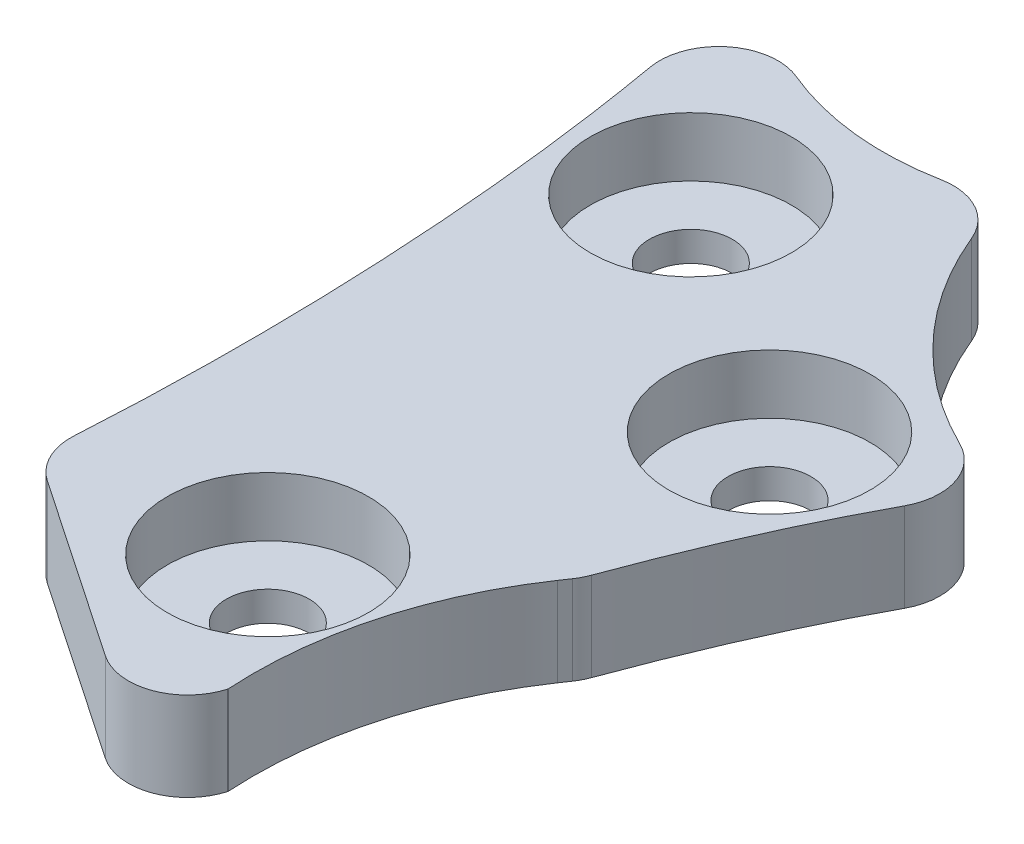
ISO-10303-21;
HEADER;
FILE_DESCRIPTION(('STEP AP214'),'2;1');
FILE_NAME('part.step','',(''),(''),'','','');
FILE_SCHEMA(('AUTOMOTIVE_DESIGN { 1 0 10303 214 1 1 1 1 }'));
ENDSEC;
DATA;
#1=APPLICATION_CONTEXT('core data for automotive mechanical design processes');
#2=APPLICATION_PROTOCOL_DEFINITION('international standard','automotive_design',2000,#1);
#3=PRODUCT_CONTEXT('',#1,'mechanical');
#4=PRODUCT('Part','Part','',(#3));
#5=PRODUCT_RELATED_PRODUCT_CATEGORY('part','',(#4));
#6=PRODUCT_DEFINITION_FORMATION('','',#4);
#7=PRODUCT_DEFINITION_CONTEXT('part definition',#1,'design');
#8=PRODUCT_DEFINITION('design','',#6,#7);
#9=PRODUCT_DEFINITION_SHAPE('','',#8);
#10=(LENGTH_UNIT() NAMED_UNIT(*) SI_UNIT(.MILLI.,.METRE.));
#11=(NAMED_UNIT(*) PLANE_ANGLE_UNIT() SI_UNIT($,.RADIAN.));
#12=(NAMED_UNIT(*) SI_UNIT($,.STERADIAN.) SOLID_ANGLE_UNIT());
#13=UNCERTAINTY_MEASURE_WITH_UNIT(LENGTH_MEASURE(1.E-05),#10,'distance_accuracy_value','');
#14=(GEOMETRIC_REPRESENTATION_CONTEXT(3) GLOBAL_UNCERTAINTY_ASSIGNED_CONTEXT((#13)) GLOBAL_UNIT_ASSIGNED_CONTEXT((#10,
#11,#12)) REPRESENTATION_CONTEXT('',''));
#15=CARTESIAN_POINT('',(0.,0.,0.));
#16=DIRECTION('',(0.,0.,1.));
#17=DIRECTION('',(1.,0.,0.));
#18=AXIS2_PLACEMENT_3D('',#15,#16,#17);
#19=CARTESIAN_POINT('',(72.2638227481414,13.5,-58.9739479500879));
#20=DIRECTION('',(0.,-1.,0.));
#21=DIRECTION('',(0.,0.,-1.));
#22=AXIS2_PLACEMENT_3D('',#19,#20,#21);
#23=CYLINDRICAL_SURFACE('',#22,0.700000000000001);
#24=CARTESIAN_POINT('',(72.2638227481414,12.,-58.9739479500879));
#25=DIRECTION('',(0.,1.,0.));
#26=DIRECTION('',(0.,0.,1.));
#27=AXIS2_PLACEMENT_3D('',#24,#25,#26);
#28=CIRCLE('',#27,0.700000000000001);
#29=CARTESIAN_POINT('',(72.2638227481414,12.,-58.2739479500879));
#30=VERTEX_POINT('',#29);
#31=EDGE_CURVE('E625',#30,#30,#28,.T.);
#32=ORIENTED_EDGE('',*,*,#31,.F.);
#33=EDGE_LOOP('',(#32));
#34=FACE_BOUND('',#33,.T.);
#35=CARTESIAN_POINT('',(72.2638227481414,12.5,-58.9739479500879));
#36=DIRECTION('',(0.,1.,0.));
#37=DIRECTION('',(0.,0.,1.));
#38=AXIS2_PLACEMENT_3D('',#35,#36,#37);
#39=CIRCLE('',#38,0.700000000000001);
#40=CARTESIAN_POINT('',(72.2638227481414,12.5,-58.2739479500879));
#41=VERTEX_POINT('',#40);
#42=EDGE_CURVE('E637',#41,#41,#39,.T.);
#43=ORIENTED_EDGE('',*,*,#42,.T.);
#44=EDGE_LOOP('',(#43));
#45=FACE_BOUND('',#44,.T.);
#46=ADVANCED_FACE('F374',(#34,#45),#23,.F.);
#47=CARTESIAN_POINT('',(74.7091319706028,13.5,-65.0056021593207));
#48=DIRECTION('',(0.,-1.,0.));
#49=DIRECTION('',(0.,0.,-1.));
#50=AXIS2_PLACEMENT_3D('',#47,#48,#49);
#51=CYLINDRICAL_SURFACE('',#50,0.700000000000003);
#52=CARTESIAN_POINT('',(74.7091319706028,12.,-65.0056021593207));
#53=DIRECTION('',(0.,1.,0.));
#54=DIRECTION('',(0.,0.,1.));
#55=AXIS2_PLACEMENT_3D('',#52,#53,#54);
#56=CIRCLE('',#55,0.700000000000003);
#57=CARTESIAN_POINT('',(74.7091319706028,12.,-64.3056021593207));
#58=VERTEX_POINT('',#57);
#59=EDGE_CURVE('E628',#58,#58,#56,.T.);
#60=ORIENTED_EDGE('',*,*,#59,.F.);
#61=EDGE_LOOP('',(#60));
#62=FACE_BOUND('',#61,.T.);
#63=CARTESIAN_POINT('',(74.7091319706028,12.5,-65.0056021593207));
#64=DIRECTION('',(0.,1.,0.));
#65=DIRECTION('',(0.,0.,1.));
#66=AXIS2_PLACEMENT_3D('',#63,#64,#65);
#67=CIRCLE('',#66,0.700000000000003);
#68=CARTESIAN_POINT('',(74.7091319706028,12.5,-64.3056021593207));
#69=VERTEX_POINT('',#68);
#70=EDGE_CURVE('E697',#69,#69,#67,.T.);
#71=ORIENTED_EDGE('',*,*,#70,.T.);
#72=EDGE_LOOP('',(#71));
#73=FACE_BOUND('',#72,.T.);
#74=ADVANCED_FACE('F687',(#62,#73),#51,.F.);
#75=CARTESIAN_POINT('',(70.5720234472234,13.5,-67.8135076181604));
#76=DIRECTION('',(0.,-1.,0.));
#77=DIRECTION('',(0.,0.,-1.));
#78=AXIS2_PLACEMENT_3D('',#75,#76,#77);
#79=CYLINDRICAL_SURFACE('',#78,0.700000000000003);
#80=CARTESIAN_POINT('',(70.5720234472234,12.,-67.8135076181604));
#81=DIRECTION('',(0.,1.,0.));
#82=DIRECTION('',(0.,0.,1.));
#83=AXIS2_PLACEMENT_3D('',#80,#81,#82);
#84=CIRCLE('',#83,0.700000000000003);
#85=CARTESIAN_POINT('',(70.5720234472234,12.,-67.1135076181604));
#86=VERTEX_POINT('',#85);
#87=EDGE_CURVE('E632',#86,#86,#84,.T.);
#88=ORIENTED_EDGE('',*,*,#87,.F.);
#89=EDGE_LOOP('',(#88));
#90=FACE_BOUND('',#89,.T.);
#91=CARTESIAN_POINT('',(70.5720234472234,12.5,-67.8135076181604));
#92=DIRECTION('',(0.,1.,0.));
#93=DIRECTION('',(0.,0.,1.));
#94=AXIS2_PLACEMENT_3D('',#91,#92,#93);
#95=CIRCLE('',#94,0.700000000000003);
#96=CARTESIAN_POINT('',(70.5720234472234,12.5,-67.1135076181604));
#97=VERTEX_POINT('',#96);
#98=EDGE_CURVE('E645',#97,#97,#95,.T.);
#99=ORIENTED_EDGE('',*,*,#98,.T.);
#100=EDGE_LOOP('',(#99));
#101=FACE_BOUND('',#100,.T.);
#102=ADVANCED_FACE('F526',(#90,#101),#79,.F.);
#103=CARTESIAN_POINT('',(80.8799392134065,13.5,-57.1137887375775));
#104=DIRECTION('',(0.,1.,0.));
#105=DIRECTION('',(0.,0.,1.));
#106=AXIS2_PLACEMENT_3D('',#103,#104,#105);
#107=PLANE('',#106);
#108=CARTESIAN_POINT('',(72.2638227481414,13.5,-58.9739479500879));
#109=DIRECTION('',(0.,1.,0.));
#110=DIRECTION('',(0.,0.,1.));
#111=AXIS2_PLACEMENT_3D('',#108,#109,#110);
#112=CIRCLE('',#111,1.70000000000001);
#113=CARTESIAN_POINT('',(72.2638227481414,13.5,-57.2739479500879));
#114=VERTEX_POINT('',#113);
#115=EDGE_CURVE('E646',#114,#114,#112,.T.);
#116=ORIENTED_EDGE('',*,*,#115,.F.);
#117=EDGE_LOOP('',(#116));
#118=FACE_BOUND('',#117,.T.);
#119=CARTESIAN_POINT('',(74.7091319706028,13.5,-65.0056021593207));
#120=DIRECTION('',(0.,1.,0.));
#121=DIRECTION('',(0.,0.,1.));
#122=AXIS2_PLACEMENT_3D('',#119,#120,#121);
#123=CIRCLE('',#122,1.70000000000001);
#124=CARTESIAN_POINT('',(74.7091319706028,13.5,-63.3056021593207));
#125=VERTEX_POINT('',#124);
#126=EDGE_CURVE('E652',#125,#125,#123,.T.);
#127=ORIENTED_EDGE('',*,*,#126,.F.);
#128=EDGE_LOOP('',(#127));
#129=FACE_BOUND('',#128,.T.);
#130=CARTESIAN_POINT('',(70.5720234472234,13.5,-67.8135076181604));
#131=DIRECTION('',(0.,1.,0.));
#132=DIRECTION('',(0.,0.,1.));
#133=AXIS2_PLACEMENT_3D('',#130,#131,#132);
#134=CIRCLE('',#133,1.70000000000001);
#135=CARTESIAN_POINT('',(70.5720234472234,13.5,-66.1135076181603));
#136=VERTEX_POINT('',#135);
#137=EDGE_CURVE('E638',#136,#136,#134,.T.);
#138=ORIENTED_EDGE('',*,*,#137,.F.);
#139=EDGE_LOOP('',(#138));
#140=FACE_BOUND('',#139,.T.);
#141=CARTESIAN_POINT('',(71.5720234472234,13.5,-74.8135076181604));
#142=DIRECTION('',(0.,-1.,0.));
#143=DIRECTION('',(0.,0.,1.));
#144=AXIS2_PLACEMENT_3D('',#141,#142,#143);
#145=CIRCLE('',#144,4.75);
#146=CARTESIAN_POINT('',(72.4683395299941,13.5,-70.1488406976004));
#147=VERTEX_POINT('',#146);
#148=CARTESIAN_POINT('',(69.7321408874091,13.5,-70.4343145228412));
#149=VERTEX_POINT('',#148);
#150=EDGE_CURVE('E563',#147,#149,#145,.T.);
#151=ORIENTED_EDGE('',*,*,#150,.T.);
#152=CARTESIAN_POINT('',(69.3447971906061,13.5,-69.5123791343529));
#153=DIRECTION('',(0.,1.,0.));
#154=DIRECTION('',(0.,0.,1.));
#155=AXIS2_PLACEMENT_3D('',#152,#153,#154);
#156=CIRCLE('',#155,1.);
#157=CARTESIAN_POINT('',(68.3597841618872,13.5,-69.3396722839055));
#158=VERTEX_POINT('',#157);
#159=EDGE_CURVE('E12',#149,#158,#156,.T.);
#160=ORIENTED_EDGE('',*,*,#159,.T.);
#161=CARTESIAN_POINT('',(68.8890316319641,13.5,-59.0760100308946));
#162=CARTESIAN_POINT('',(68.9430490469193,13.5,-59.9636197636759));
#163=CARTESIAN_POINT('',(68.9711298068894,13.5,-60.8525883147822));
#164=CARTESIAN_POINT('',(68.9776496461561,13.5,-62.8176238059093));
#165=CARTESIAN_POINT('',(68.9453470630465,13.5,-63.8940870276276));
#166=CARTESIAN_POINT('',(68.804800726142,13.5,-66.0459856312375));
#167=CARTESIAN_POINT('',(68.6957766560887,13.5,-67.1178787166003));
#168=CARTESIAN_POINT('',(68.488180782614,13.5,-68.5698284901652));
#169=CARTESIAN_POINT('',(68.4272267815894,13.5,-68.9552480453798));
#170=CARTESIAN_POINT('',(68.3598227341784,13.5,-69.3396790469619));
#171=B_SPLINE_CURVE_WITH_KNOTS('',3,(#161,#162,#163,#164,#165,#166,#167,#168,#169,#170),
.UNSPECIFIED.,.F.,.F.,(4,2,2,2,4),(0.159481537734136,0.36563959977013,0.61563959977013,
0.86563959977013,0.956158062035995),.UNSPECIFIED.);
#172=CARTESIAN_POINT('',(68.889034732794,13.5,-59.0760098421869));
#173=VERTEX_POINT('',#172);
#174=EDGE_CURVE('E608',#158,#173,#171,.F.);
#175=ORIENTED_EDGE('',*,*,#174,.T.);
#176=CARTESIAN_POINT('',(69.8871849624101,13.5,-59.0152652457716));
#177=DIRECTION('',(0.,1.,0.));
#178=DIRECTION('',(0.,0.,1.));
#179=AXIS2_PLACEMENT_3D('',#176,#177,#178);
#180=CIRCLE('',#179,1.);
#181=CARTESIAN_POINT('',(69.3256038706421,13.5,-58.1878435410957));
#182=VERTEX_POINT('',#181);
#183=EDGE_CURVE('E787',#173,#182,#180,.T.);
#184=ORIENTED_EDGE('',*,*,#183,.T.);
#185=DIRECTION('',(0.827421704675876,0.,0.561581091767937));
#186=VECTOR('',#185,1.);
#187=CARTESIAN_POINT('',(68.8510426391012,13.5,-58.5099339733547));
#188=LINE('',#187,#186);
#189=CARTESIAN_POINT('',(72.3716664457096,13.5,-56.1204441281568));
#190=VERTEX_POINT('',#189);
#191=EDGE_CURVE('E503',#182,#190,#188,.T.);
#192=ORIENTED_EDGE('',*,*,#191,.T.);
#193=CARTESIAN_POINT('',(72.9332475374775,13.5,-56.9478658328327));
#194=DIRECTION('',(0.,1.,0.));
#195=DIRECTION('',(0.,0.,1.));
#196=AXIS2_PLACEMENT_3D('',#193,#194,#195);
#197=CIRCLE('',#196,1.);
#198=CARTESIAN_POINT('',(73.8939934398076,13.5,-56.6704360017835));
#199=VERTEX_POINT('',#198);
#200=EDGE_CURVE('E488',#190,#199,#197,.T.);
#201=ORIENTED_EDGE('',*,*,#200,.T.);
#202=CARTESIAN_POINT('',(80.8799392134065,13.5,-57.1137887375775));
#203=DIRECTION('',(0.,-1.,0.));
#204=DIRECTION('',(0.,0.,1.));
#205=AXIS2_PLACEMENT_3D('',#202,#203,#204);
#206=CIRCLE('',#205,7.00000000000001);
#207=CARTESIAN_POINT('',(75.0879872806754,13.5,-61.0448563799531));
#208=VERTEX_POINT('',#207);
#209=EDGE_CURVE('E482',#199,#208,#206,.T.);
#210=ORIENTED_EDGE('',*,*,#209,.T.);
#211=DIRECTION('',(0.561581091768055,0.,-0.827421704675795));
#212=VECTOR('',#211,1.);
#213=CARTESIAN_POINT('',(75.0879872806754,13.5,-61.0448563799531));
#214=LINE('',#213,#212);
#215=CARTESIAN_POINT('',(75.1890511431007,13.5,-61.1937617376207));
#216=VERTEX_POINT('',#215);
#217=EDGE_CURVE('E470',#208,#216,#214,.T.);
#218=ORIENTED_EDGE('',*,*,#217,.T.);
#219=CARTESIAN_POINT('',(74.3616294384249,13.5,-61.7553428293887));
#220=DIRECTION('',(0.,1.,0.));
#221=DIRECTION('',(0.,0.,1.));
#222=AXIS2_PLACEMENT_3D('',#219,#220,#221);
#223=CIRCLE('',#222,1.);
#224=CARTESIAN_POINT('',(75.3003538092592,13.5,-61.4106706861503));
#225=VERTEX_POINT('',#224);
#226=EDGE_CURVE('E794',#216,#225,#223,.T.);
#227=ORIENTED_EDGE('',*,*,#226,.T.);
#228=CARTESIAN_POINT('',(76.9276341794383,13.5,-65.0651191019532));
#229=CARTESIAN_POINT('',(76.6902697689844,13.5,-64.6288377391433));
#230=CARTESIAN_POINT('',(76.4688595301773,13.5,-64.183942429396));
#231=CARTESIAN_POINT('',(75.9060309782182,13.5,-62.9735073442266));
#232=CARTESIAN_POINT('',(75.5891769925725,13.5,-62.1972922099058));
#233=CARTESIAN_POINT('',(75.300352715308,13.5,-61.4106710878172));
#234=B_SPLINE_CURVE_WITH_KNOTS('',3,(#228,#229,#230,#231,#232,#233),.UNSPECIFIED.,.F.,.F.,(4,2,
4),(0.0231369779908018,0.306065370487194,0.782928392496392),.UNSPECIFIED.);
#235=CARTESIAN_POINT('',(76.9277741043817,13.5,-65.0650429740126));
#236=VERTEX_POINT('',#235);
#237=EDGE_CURVE('E481',#225,#236,#234,.F.);
#238=ORIENTED_EDGE('',*,*,#237,.T.);
#239=CARTESIAN_POINT('',(76.0492251209714,13.5,-65.5430286394217));
#240=DIRECTION('',(0.,1.,0.));
#241=DIRECTION('',(0.,0.,1.));
#242=AXIS2_PLACEMENT_3D('',#239,#240,#241);
#243=CIRCLE('',#242,1.);
#244=CARTESIAN_POINT('',(76.489549065633,13.5,-66.4408676137138));
#245=VERTEX_POINT('',#244);
#246=EDGE_CURVE('E782',#236,#245,#243,.T.);
#247=ORIENTED_EDGE('',*,*,#246,.T.);
#248=CARTESIAN_POINT('',(79.1314927336023,13.5,-71.8279014594657));
#249=DIRECTION('',(0.,-1.,0.));
#250=DIRECTION('',(0.,0.,1.));
#251=AXIS2_PLACEMENT_3D('',#248,#249,#250);
#252=CIRCLE('',#251,5.99999999999999);
#253=CARTESIAN_POINT('',(73.5819598070998,13.5,-69.5469621140064));
#254=VERTEX_POINT('',#253);
#255=EDGE_CURVE('E559',#245,#254,#252,.T.);
#256=ORIENTED_EDGE('',*,*,#255,.T.);
#257=CARTESIAN_POINT('',(72.6570376526827,13.5,-69.1668055564299));
#258=DIRECTION('',(0.,1.,0.));
#259=DIRECTION('',(0.,0.,1.));
#260=AXIS2_PLACEMENT_3D('',#257,#258,#259);
#261=CIRCLE('',#260,1.);
#262=EDGE_CURVE('E798',#254,#147,#261,.T.);
#263=ORIENTED_EDGE('',*,*,#262,.T.);
#264=EDGE_LOOP('',(#151,#160,#175,#184,#192,#201,#210,#218,#227,#238,#247,#256,#263));
#265=FACE_BOUND('',#264,.T.);
#266=ADVANCED_FACE('F485',(#118,#129,#140,#265),#107,.T.);
#267=CARTESIAN_POINT('',(80.8799392134065,12.,-57.1137887375775));
#268=DIRECTION('',(0.,1.,0.));
#269=DIRECTION('',(0.,0.,1.));
#270=AXIS2_PLACEMENT_3D('',#267,#268,#269);
#271=PLANE('',#270);
#272=CARTESIAN_POINT('',(68.3598227336738,12.,-69.3396790498397));
#273=CARTESIAN_POINT('',(68.4272267812852,12.,-68.9552480473033));
#274=CARTESIAN_POINT('',(68.4881807824763,12.,-68.5698284911282));
#275=CARTESIAN_POINT('',(68.6957766560887,12.,-67.1178787166003));
#276=CARTESIAN_POINT('',(68.804800726142,12.,-66.0459856312375));
#277=CARTESIAN_POINT('',(68.9453470630465,12.,-63.8940870276276));
#278=CARTESIAN_POINT('',(68.9776496461561,12.,-62.8176238059093));
#279=CARTESIAN_POINT('',(68.9711298068896,12.,-60.8525883148285));
#280=CARTESIAN_POINT('',(68.9430490469223,12.,-59.9636197637686));
#281=CARTESIAN_POINT('',(68.8890316319726,12.,-59.0760100310335));
#282=B_SPLINE_CURVE_WITH_KNOTS('',3,(#272,#273,#274,#275,#276,#277,#278,#279,#280,#281),
.UNSPECIFIED.,.F.,.F.,(4,2,2,2,4),(0.159481537508268,0.25,0.5,0.75,0.956158062025244),.UNSPECIFIED.);
#283=CARTESIAN_POINT('',(68.3597912673983,12.,-69.3396735309063));
#284=VERTEX_POINT('',#283);
#285=CARTESIAN_POINT('',(68.8890337670325,12.,-59.0760099010751));
#286=VERTEX_POINT('',#285);
#287=EDGE_CURVE('E620',#284,#286,#282,.T.);
#288=ORIENTED_EDGE('',*,*,#287,.F.);
#289=CARTESIAN_POINT('',(69.3447971906061,12.,-69.5123791343529));
#290=DIRECTION('',(0.,1.,0.));
#291=DIRECTION('',(0.,0.,1.));
#292=AXIS2_PLACEMENT_3D('',#289,#290,#291);
#293=CIRCLE('',#292,1.);
#294=CARTESIAN_POINT('',(69.7321408874091,12.,-70.4343145228412));
#295=VERTEX_POINT('',#294);
#296=EDGE_CURVE('E397',#284,#295,#293,.F.);
#297=ORIENTED_EDGE('',*,*,#296,.T.);
#298=CARTESIAN_POINT('',(71.5720234472234,12.,-74.8135076181604));
#299=DIRECTION('',(0.,-1.,0.));
#300=DIRECTION('',(0.,0.,1.));
#301=AXIS2_PLACEMENT_3D('',#298,#299,#300);
#302=CIRCLE('',#301,4.75);
#303=CARTESIAN_POINT('',(72.4683395299941,12.,-70.1488406976004));
#304=VERTEX_POINT('',#303);
#305=EDGE_CURVE('E618',#304,#295,#302,.T.);
#306=ORIENTED_EDGE('',*,*,#305,.F.);
#307=CARTESIAN_POINT('',(72.6570376526827,12.,-69.1668055564299));
#308=DIRECTION('',(0.,1.,0.));
#309=DIRECTION('',(0.,0.,1.));
#310=AXIS2_PLACEMENT_3D('',#307,#308,#309);
#311=CIRCLE('',#310,1.);
#312=CARTESIAN_POINT('',(73.5819598070998,12.,-69.5469621140064));
#313=VERTEX_POINT('',#312);
#314=EDGE_CURVE('E553',#304,#313,#311,.F.);
#315=ORIENTED_EDGE('',*,*,#314,.T.);
#316=CARTESIAN_POINT('',(79.1314927336023,12.,-71.8279014594657));
#317=DIRECTION('',(0.,-1.,0.));
#318=DIRECTION('',(0.,0.,1.));
#319=AXIS2_PLACEMENT_3D('',#316,#317,#318);
#320=CIRCLE('',#319,5.99999999999999);
#321=CARTESIAN_POINT('',(76.489549065633,12.,-66.4408676137138));
#322=VERTEX_POINT('',#321);
#323=EDGE_CURVE('E621',#322,#313,#320,.T.);
#324=ORIENTED_EDGE('',*,*,#323,.F.);
#325=CARTESIAN_POINT('',(76.0492251209714,12.,-65.5430286394217));
#326=DIRECTION('',(0.,1.,0.));
#327=DIRECTION('',(0.,0.,1.));
#328=AXIS2_PLACEMENT_3D('',#325,#326,#327);
#329=CIRCLE('',#328,1.);
#330=CARTESIAN_POINT('',(76.9277803455668,12.,-65.0650395677012));
#331=VERTEX_POINT('',#330);
#332=EDGE_CURVE('E501',#322,#331,#329,.F.);
#333=ORIENTED_EDGE('',*,*,#332,.T.);
#334=CARTESIAN_POINT('',(75.3003527153268,12.,-61.4106710878686));
#335=CARTESIAN_POINT('',(75.5891769925863,12.,-62.1972922099396));
#336=CARTESIAN_POINT('',(75.9060309782259,12.,-62.9735073442431));
#337=CARTESIAN_POINT('',(76.4688595262765,12.,-64.1839424210067));
#338=CARTESIAN_POINT('',(76.6902697607426,12.,-64.6288377225824));
#339=CARTESIAN_POINT('',(76.9276341661847,12.,-65.0651190775927));
#340=B_SPLINE_CURVE_WITH_KNOTS('',3,(#334,#335,#336,#337,#338,#339),.UNSPECIFIED.,.F.,.F.,(4,2,
4),(0.0231369780011824,0.5,0.782928387230468),.UNSPECIFIED.);
#341=CARTESIAN_POINT('',(75.3003537291231,12.,-61.4106707155934));
#342=VERTEX_POINT('',#341);
#343=EDGE_CURVE('E626',#342,#331,#340,.T.);
#344=ORIENTED_EDGE('',*,*,#343,.F.);
#345=CARTESIAN_POINT('',(74.3616294384249,12.,-61.7553428293887));
#346=DIRECTION('',(0.,1.,0.));
#347=DIRECTION('',(0.,0.,1.));
#348=AXIS2_PLACEMENT_3D('',#345,#346,#347);
#349=CIRCLE('',#348,1.);
#350=CARTESIAN_POINT('',(75.1890511431007,12.,-61.1937617376207));
#351=VERTEX_POINT('',#350);
#352=EDGE_CURVE('E789',#342,#351,#349,.F.);
#353=ORIENTED_EDGE('',*,*,#352,.T.);
#354=DIRECTION('',(0.561581091768055,0.,-0.827421704675795));
#355=VECTOR('',#354,1.);
#356=CARTESIAN_POINT('',(75.0879872806754,12.,-61.0448563799531));
#357=LINE('',#356,#355);
#358=CARTESIAN_POINT('',(75.0879872806754,12.,-61.0448563799531));
#359=VERTEX_POINT('',#358);
#360=EDGE_CURVE('E624',#359,#351,#357,.T.);
#361=ORIENTED_EDGE('',*,*,#360,.F.);
#362=CARTESIAN_POINT('',(80.8799392134065,12.,-57.1137887375775));
#363=DIRECTION('',(0.,-1.,0.));
#364=DIRECTION('',(0.,0.,1.));
#365=AXIS2_PLACEMENT_3D('',#362,#363,#364);
#366=CIRCLE('',#365,7.00000000000001);
#367=CARTESIAN_POINT('',(73.8939934398076,12.,-56.6704360017835));
#368=VERTEX_POINT('',#367);
#369=EDGE_CURVE('E496',#368,#359,#366,.T.);
#370=ORIENTED_EDGE('',*,*,#369,.F.);
#371=CARTESIAN_POINT('',(72.9332475374775,12.,-56.9478658328327));
#372=DIRECTION('',(0.,1.,0.));
#373=DIRECTION('',(0.,0.,1.));
#374=AXIS2_PLACEMENT_3D('',#371,#372,#373);
#375=CIRCLE('',#374,1.);
#376=CARTESIAN_POINT('',(72.3716664457096,12.,-56.1204441281568));
#377=VERTEX_POINT('',#376);
#378=EDGE_CURVE('E848',#368,#377,#375,.F.);
#379=ORIENTED_EDGE('',*,*,#378,.T.);
#380=DIRECTION('',(0.827421704675876,0.,0.561581091767937));
#381=VECTOR('',#380,1.);
#382=CARTESIAN_POINT('',(68.8510426391012,12.,-58.5099339733547));
#383=LINE('',#382,#381);
#384=CARTESIAN_POINT('',(69.3256038706421,12.,-58.1878435410957));
#385=VERTEX_POINT('',#384);
#386=EDGE_CURVE('E492',#385,#377,#383,.T.);
#387=ORIENTED_EDGE('',*,*,#386,.F.);
#388=CARTESIAN_POINT('',(69.8871849624101,12.,-59.0152652457716));
#389=DIRECTION('',(0.,1.,0.));
#390=DIRECTION('',(0.,0.,1.));
#391=AXIS2_PLACEMENT_3D('',#388,#389,#390);
#392=CIRCLE('',#391,1.);
#393=EDGE_CURVE('E850',#385,#286,#392,.F.);
#394=ORIENTED_EDGE('',*,*,#393,.T.);
#395=EDGE_LOOP('',(#288,#297,#306,#315,#324,#333,#344,#353,#361,#370,#379,#387,#394));
#396=FACE_BOUND('',#395,.T.);
#397=ORIENTED_EDGE('',*,*,#31,.T.);
#398=EDGE_LOOP('',(#397));
#399=FACE_BOUND('',#398,.T.);
#400=ORIENTED_EDGE('',*,*,#59,.T.);
#401=EDGE_LOOP('',(#400));
#402=FACE_BOUND('',#401,.T.);
#403=ORIENTED_EDGE('',*,*,#87,.T.);
#404=EDGE_LOOP('',(#403));
#405=FACE_BOUND('',#404,.T.);
#406=ADVANCED_FACE('F525',(#396,#399,#402,#405),#271,.F.);
#407=CARTESIAN_POINT('',(80.8799392134065,13.5,-57.1137887375775));
#408=DIRECTION('',(0.,-1.,0.));
#409=DIRECTION('',(0.,0.,-1.));
#410=AXIS2_PLACEMENT_3D('',#407,#408,#409);
#411=CYLINDRICAL_SURFACE('',#410,7.00000000000001);
#412=ORIENTED_EDGE('',*,*,#369,.T.);
#413=DIRECTION('',(0.,-1.,0.));
#414=VECTOR('',#413,1.);
#415=CARTESIAN_POINT('',(75.0879872806754,13.5,-61.0448563799531));
#416=LINE('',#415,#414);
#417=EDGE_CURVE('E475',#208,#359,#416,.T.);
#418=ORIENTED_EDGE('',*,*,#417,.F.);
#419=ORIENTED_EDGE('',*,*,#209,.F.);
#420=DIRECTION('',(0.,-1.,0.));
#421=VECTOR('',#420,1.);
#422=CARTESIAN_POINT('',(73.8939934398076,13.5,-56.6704360017835));
#423=LINE('',#422,#421);
#424=EDGE_CURVE('E498',#199,#368,#423,.T.);
#425=ORIENTED_EDGE('',*,*,#424,.T.);
#426=EDGE_LOOP('',(#412,#418,#419,#425));
#427=FACE_BOUND('',#426,.T.);
#428=ADVANCED_FACE('F494',(#427),#411,.F.);
#429=CARTESIAN_POINT('',(75.0879872806754,13.5,-61.0448563799531));
#430=DIRECTION('',(-0.827421704675795,0.,-0.561581091768055));
#431=DIRECTION('',(-0.561581091768055,0.,0.827421704675795));
#432=AXIS2_PLACEMENT_3D('',#429,#430,#431);
#433=PLANE('',#432);
#434=ORIENTED_EDGE('',*,*,#360,.T.);
#435=DIRECTION('',(0.,-1.,0.));
#436=VECTOR('',#435,1.);
#437=CARTESIAN_POINT('',(75.1890511431007,13.5,-61.1937617376207));
#438=LINE('',#437,#436);
#439=EDGE_CURVE('E478',#351,#216,#438,.F.);
#440=ORIENTED_EDGE('',*,*,#439,.T.);
#441=ORIENTED_EDGE('',*,*,#217,.F.);
#442=ORIENTED_EDGE('',*,*,#417,.T.);
#443=EDGE_LOOP('',(#434,#440,#441,#442));
#444=FACE_BOUND('',#443,.T.);
#445=ADVANCED_FACE('F473',(#444),#433,.F.);
#446=CARTESIAN_POINT('',(75.2585092088298,13.5,-61.2960997828139));
#447=CARTESIAN_POINT('',(75.5585157014917,13.5,-62.1219307630658));
#448=CARTESIAN_POINT('',(75.888891864021,13.5,-62.9366474779657));
#449=CARTESIAN_POINT('',(76.6296590551393,13.5,-64.5297624593413));
#450=CARTESIAN_POINT('',(77.0369770462897,13.5,-65.3080742839665));
#451=CARTESIAN_POINT('',(77.504012934387,13.5,-66.0528421954281));
#452=B_SPLINE_CURVE_WITH_KNOTS('',3,(#446,#447,#448,#449,#450,#451),.UNSPECIFIED.,.F.,.F.,(4,2,
4),(0.,0.5,1.),.UNSPECIFIED.);
#453=DIRECTION('',(0.,-1.,0.));
#454=VECTOR('',#453,1.);
#455=SURFACE_OF_LINEAR_EXTRUSION('',#452,#454);
#456=ORIENTED_EDGE('',*,*,#237,.F.);
#457=DIRECTION('',(0.,-1.,0.));
#458=VECTOR('',#457,1.);
#459=CARTESIAN_POINT('',(75.300352715352,13.5,-61.4106710879371));
#460=LINE('',#459,#458);
#461=EDGE_CURVE('E809',#225,#342,#460,.T.);
#462=ORIENTED_EDGE('',*,*,#461,.T.);
#463=ORIENTED_EDGE('',*,*,#343,.T.);
#464=DIRECTION('',(0.,-1.,0.));
#465=VECTOR('',#464,1.);
#466=CARTESIAN_POINT('',(76.9276341574294,12.,-65.0651190615003));
#467=LINE('',#466,#465);
#468=EDGE_CURVE('E783',#331,#236,#467,.F.);
#469=ORIENTED_EDGE('',*,*,#468,.T.);
#470=EDGE_LOOP('',(#456,#462,#463,#469));
#471=FACE_BOUND('',#470,.T.);
#472=ADVANCED_FACE('F576',(#471),#455,.F.);
#473=CARTESIAN_POINT('',(79.1314927336023,13.5,-71.8279014594657));
#474=DIRECTION('',(0.,-1.,0.));
#475=DIRECTION('',(0.,0.,-1.));
#476=AXIS2_PLACEMENT_3D('',#473,#474,#475);
#477=CYLINDRICAL_SURFACE('',#476,5.99999999999999);
#478=ORIENTED_EDGE('',*,*,#323,.T.);
#479=DIRECTION('',(0.,-1.,0.));
#480=VECTOR('',#479,1.);
#481=CARTESIAN_POINT('',(73.5819598070998,13.5,-69.5469621140064));
#482=LINE('',#481,#480);
#483=EDGE_CURVE('E806',#313,#254,#482,.F.);
#484=ORIENTED_EDGE('',*,*,#483,.T.);
#485=ORIENTED_EDGE('',*,*,#255,.F.);
#486=DIRECTION('',(0.,-1.,0.));
#487=VECTOR('',#486,1.);
#488=CARTESIAN_POINT('',(76.489549065633,13.5,-66.4408676137138));
#489=LINE('',#488,#487);
#490=EDGE_CURVE('E785',#245,#322,#489,.T.);
#491=ORIENTED_EDGE('',*,*,#490,.T.);
#492=EDGE_LOOP('',(#478,#484,#485,#491));
#493=FACE_BOUND('',#492,.T.);
#494=ADVANCED_FACE('F587',(#493),#477,.F.);
#495=CARTESIAN_POINT('',(71.5720234472234,13.5,-74.8135076181604));
#496=DIRECTION('',(0.,-1.,0.));
#497=DIRECTION('',(0.,0.,-1.));
#498=AXIS2_PLACEMENT_3D('',#495,#496,#497);
#499=CYLINDRICAL_SURFACE('',#498,4.75);
#500=ORIENTED_EDGE('',*,*,#305,.T.);
#501=DIRECTION('',(0.,-1.,0.));
#502=VECTOR('',#501,1.);
#503=CARTESIAN_POINT('',(69.7321408874091,13.5,-70.4343145228412));
#504=LINE('',#503,#502);
#505=EDGE_CURVE('E383',#295,#149,#504,.F.);
#506=ORIENTED_EDGE('',*,*,#505,.T.);
#507=ORIENTED_EDGE('',*,*,#150,.F.);
#508=DIRECTION('',(0.,-1.,0.));
#509=VECTOR('',#508,1.);
#510=CARTESIAN_POINT('',(72.4683395299941,13.5,-70.1488406976004));
#511=LINE('',#510,#509);
#512=EDGE_CURVE('E802',#147,#304,#511,.T.);
#513=ORIENTED_EDGE('',*,*,#512,.T.);
#514=EDGE_LOOP('',(#500,#506,#507,#513));
#515=FACE_BOUND('',#514,.T.);
#516=ADVANCED_FACE('F837',(#515),#499,.F.);
#517=CARTESIAN_POINT('',(67.9397647819198,13.5,-71.36));
#518=CARTESIAN_POINT('',(68.1945307343924,13.5,-70.3116707937573));
#519=CARTESIAN_POINT('',(68.3909534284532,13.5,-69.2498479553654));
#520=CARTESIAN_POINT('',(68.6957766560887,13.5,-67.1178787166003));
#521=CARTESIAN_POINT('',(68.804800726142,13.5,-66.0459856312375));
#522=CARTESIAN_POINT('',(68.9453470630465,13.5,-63.8940870276276));
#523=CARTESIAN_POINT('',(68.9776496461561,13.5,-62.8176238059093));
#524=CARTESIAN_POINT('',(68.9705031767529,13.5,-60.6637262266837));
#525=CARTESIAN_POINT('',(68.9299689459229,13.5,-59.5854806344202));
#526=CARTESIAN_POINT('',(68.8510426391011,13.5,-58.5099339733547));
#527=B_SPLINE_CURVE_WITH_KNOTS('',3,(#517,#518,#519,#520,#521,#522,#523,#524,#525,#526),
.UNSPECIFIED.,.F.,.F.,(4,2,2,2,4),(0.,0.25,0.5,0.75,1.),.UNSPECIFIED.);
#528=DIRECTION('',(0.,-1.,0.));
#529=VECTOR('',#528,1.);
#530=SURFACE_OF_LINEAR_EXTRUSION('',#527,#529);
#531=ORIENTED_EDGE('',*,*,#174,.F.);
#532=DIRECTION('',(0.,-1.,0.));
#533=VECTOR('',#532,1.);
#534=CARTESIAN_POINT('',(68.3598227330559,13.5,-69.3396790533642));
#535=LINE('',#534,#533);
#536=EDGE_CURVE('E613',#158,#284,#535,.T.);
#537=ORIENTED_EDGE('',*,*,#536,.T.);
#538=ORIENTED_EDGE('',*,*,#287,.T.);
#539=DIRECTION('',(0.,-1.,0.));
#540=VECTOR('',#539,1.);
#541=CARTESIAN_POINT('',(68.8890316319741,12.,-59.076010031058));
#542=LINE('',#541,#540);
#543=EDGE_CURVE('E497',#286,#173,#542,.F.);
#544=ORIENTED_EDGE('',*,*,#543,.T.);
#545=EDGE_LOOP('',(#531,#537,#538,#544));
#546=FACE_BOUND('',#545,.T.);
#547=ADVANCED_FACE('F682',(#546),#530,.F.);
#548=CARTESIAN_POINT('',(68.8510426391012,13.5,-58.5099339733547));
#549=DIRECTION('',(0.561581091767936,0.,-0.827421704675876));
#550=DIRECTION('',(-0.827421704675876,0.,-0.561581091767937));
#551=AXIS2_PLACEMENT_3D('',#548,#549,#550);
#552=PLANE('',#551);
#553=ORIENTED_EDGE('',*,*,#191,.F.);
#554=DIRECTION('',(0.,-1.,0.));
#555=VECTOR('',#554,1.);
#556=CARTESIAN_POINT('',(69.3256038706421,13.5,-58.1878435410957));
#557=LINE('',#556,#555);
#558=EDGE_CURVE('E615',#182,#385,#557,.T.);
#559=ORIENTED_EDGE('',*,*,#558,.T.);
#560=ORIENTED_EDGE('',*,*,#386,.T.);
#561=DIRECTION('',(0.,1.,0.));
#562=VECTOR('',#561,1.);
#563=CARTESIAN_POINT('',(72.3716664457096,13.5,-56.1204441281568));
#564=LINE('',#563,#562);
#565=EDGE_CURVE('E816',#377,#190,#564,.T.);
#566=ORIENTED_EDGE('',*,*,#565,.T.);
#567=EDGE_LOOP('',(#553,#559,#560,#566));
#568=FACE_BOUND('',#567,.T.);
#569=ADVANCED_FACE('F672',(#568),#552,.F.);
#570=CARTESIAN_POINT('',(70.5720234472234,12.5,-67.8135076181604));
#571=DIRECTION('',(0.,1.,0.));
#572=DIRECTION('',(0.,0.,1.));
#573=AXIS2_PLACEMENT_3D('',#570,#571,#572);
#574=CYLINDRICAL_SURFACE('',#573,1.70000000000001);
#575=CARTESIAN_POINT('',(70.5720234472234,12.5,-67.8135076181604));
#576=DIRECTION('',(0.,1.,0.));
#577=DIRECTION('',(0.,0.,1.));
#578=AXIS2_PLACEMENT_3D('',#575,#576,#577);
#579=CIRCLE('',#578,1.70000000000001);
#580=CARTESIAN_POINT('',(70.5720234472234,12.5,-66.1135076181603));
#581=VERTEX_POINT('',#580);
#582=EDGE_CURVE('E641',#581,#581,#579,.T.);
#583=ORIENTED_EDGE('',*,*,#582,.F.);
#584=EDGE_LOOP('',(#583));
#585=FACE_BOUND('',#584,.T.);
#586=ORIENTED_EDGE('',*,*,#137,.T.);
#587=EDGE_LOOP('',(#586));
#588=FACE_BOUND('',#587,.T.);
#589=ADVANCED_FACE('F670',(#585,#588),#574,.F.);
#590=CARTESIAN_POINT('',(70.5720234472234,12.5,-67.8135076181604));
#591=DIRECTION('',(0.,1.,0.));
#592=DIRECTION('',(0.,0.,1.));
#593=AXIS2_PLACEMENT_3D('',#590,#591,#592);
#594=PLANE('',#593);
#595=ORIENTED_EDGE('',*,*,#98,.F.);
#596=EDGE_LOOP('',(#595));
#597=FACE_BOUND('',#596,.T.);
#598=ORIENTED_EDGE('',*,*,#582,.T.);
#599=EDGE_LOOP('',(#598));
#600=FACE_BOUND('',#599,.T.);
#601=ADVANCED_FACE('F663',(#597,#600),#594,.T.);
#602=CARTESIAN_POINT('',(74.7091319706028,12.5,-65.0056021593207));
#603=DIRECTION('',(0.,1.,0.));
#604=DIRECTION('',(0.,0.,1.));
#605=AXIS2_PLACEMENT_3D('',#602,#603,#604);
#606=CYLINDRICAL_SURFACE('',#605,1.70000000000001);
#607=CARTESIAN_POINT('',(74.7091319706028,12.5,-65.0056021593207));
#608=DIRECTION('',(0.,1.,0.));
#609=DIRECTION('',(0.,0.,1.));
#610=AXIS2_PLACEMENT_3D('',#607,#608,#609);
#611=CIRCLE('',#610,1.70000000000001);
#612=CARTESIAN_POINT('',(74.7091319706028,12.5,-63.3056021593207));
#613=VERTEX_POINT('',#612);
#614=EDGE_CURVE('E642',#613,#613,#611,.T.);
#615=ORIENTED_EDGE('',*,*,#614,.F.);
#616=EDGE_LOOP('',(#615));
#617=FACE_BOUND('',#616,.T.);
#618=ORIENTED_EDGE('',*,*,#126,.T.);
#619=EDGE_LOOP('',(#618));
#620=FACE_BOUND('',#619,.T.);
#621=ADVANCED_FACE('F660',(#617,#620),#606,.F.);
#622=CARTESIAN_POINT('',(74.7091319706028,12.5,-65.0056021593207));
#623=DIRECTION('',(0.,1.,0.));
#624=DIRECTION('',(0.,0.,1.));
#625=AXIS2_PLACEMENT_3D('',#622,#623,#624);
#626=PLANE('',#625);
#627=ORIENTED_EDGE('',*,*,#70,.F.);
#628=EDGE_LOOP('',(#627));
#629=FACE_BOUND('',#628,.T.);
#630=ORIENTED_EDGE('',*,*,#614,.T.);
#631=EDGE_LOOP('',(#630));
#632=FACE_BOUND('',#631,.T.);
#633=ADVANCED_FACE('F658',(#629,#632),#626,.T.);
#634=CARTESIAN_POINT('',(72.2638227481414,12.5,-58.9739479500879));
#635=DIRECTION('',(0.,1.,0.));
#636=DIRECTION('',(0.,0.,1.));
#637=AXIS2_PLACEMENT_3D('',#634,#635,#636);
#638=CYLINDRICAL_SURFACE('',#637,1.70000000000001);
#639=CARTESIAN_POINT('',(72.2638227481414,12.5,-58.9739479500879));
#640=DIRECTION('',(0.,1.,0.));
#641=DIRECTION('',(0.,0.,1.));
#642=AXIS2_PLACEMENT_3D('',#639,#640,#641);
#643=CIRCLE('',#642,1.70000000000001);
#644=CARTESIAN_POINT('',(72.2638227481414,12.5,-57.2739479500879));
#645=VERTEX_POINT('',#644);
#646=EDGE_CURVE('E649',#645,#645,#643,.T.);
#647=ORIENTED_EDGE('',*,*,#646,.F.);
#648=EDGE_LOOP('',(#647));
#649=FACE_BOUND('',#648,.T.);
#650=ORIENTED_EDGE('',*,*,#115,.T.);
#651=EDGE_LOOP('',(#650));
#652=FACE_BOUND('',#651,.T.);
#653=ADVANCED_FACE('F738',(#649,#652),#638,.F.);
#654=CARTESIAN_POINT('',(72.2638227481414,12.5,-58.9739479500879));
#655=DIRECTION('',(0.,1.,0.));
#656=DIRECTION('',(0.,0.,1.));
#657=AXIS2_PLACEMENT_3D('',#654,#655,#656);
#658=PLANE('',#657);
#659=ORIENTED_EDGE('',*,*,#42,.F.);
#660=EDGE_LOOP('',(#659));
#661=FACE_BOUND('',#660,.T.);
#662=ORIENTED_EDGE('',*,*,#646,.T.);
#663=EDGE_LOOP('',(#662));
#664=FACE_BOUND('',#663,.T.);
#665=ADVANCED_FACE('F743',(#661,#664),#658,.T.);
#666=CARTESIAN_POINT('',(72.6570376526827,13.5,-69.1668055564299));
#667=DIRECTION('',(0.,-1.,0.));
#668=DIRECTION('',(0.,0.,-1.));
#669=AXIS2_PLACEMENT_3D('',#666,#667,#668);
#670=CYLINDRICAL_SURFACE('',#669,1.);
#671=ORIENTED_EDGE('',*,*,#262,.F.);
#672=ORIENTED_EDGE('',*,*,#483,.F.);
#673=ORIENTED_EDGE('',*,*,#314,.F.);
#674=ORIENTED_EDGE('',*,*,#512,.F.);
#675=EDGE_LOOP('',(#671,#672,#673,#674));
#676=FACE_BOUND('',#675,.T.);
#677=ADVANCED_FACE('F748',(#676),#670,.T.);
#678=CARTESIAN_POINT('',(74.3616294384249,12.75,-61.7553428293887));
#679=DIRECTION('',(0.,-1.,0.));
#680=DIRECTION('',(0.,0.,-1.));
#681=AXIS2_PLACEMENT_3D('',#678,#679,#680);
#682=CYLINDRICAL_SURFACE('',#681,1.);
#683=ORIENTED_EDGE('',*,*,#226,.F.);
#684=ORIENTED_EDGE('',*,*,#439,.F.);
#685=ORIENTED_EDGE('',*,*,#352,.F.);
#686=ORIENTED_EDGE('',*,*,#461,.F.);
#687=EDGE_LOOP('',(#683,#684,#685,#686));
#688=FACE_BOUND('',#687,.T.);
#689=ADVANCED_FACE('F752',(#688),#682,.T.);
#690=CARTESIAN_POINT('',(69.8871849624101,12.75,-59.0152652457716));
#691=DIRECTION('',(0.,-1.,0.));
#692=DIRECTION('',(0.,0.,-1.));
#693=AXIS2_PLACEMENT_3D('',#690,#691,#692);
#694=CYLINDRICAL_SURFACE('',#693,1.);
#695=ORIENTED_EDGE('',*,*,#183,.F.);
#696=ORIENTED_EDGE('',*,*,#543,.F.);
#697=ORIENTED_EDGE('',*,*,#393,.F.);
#698=ORIENTED_EDGE('',*,*,#558,.F.);
#699=EDGE_LOOP('',(#695,#696,#697,#698));
#700=FACE_BOUND('',#699,.T.);
#701=ADVANCED_FACE('F762',(#700),#694,.T.);
#702=CARTESIAN_POINT('',(72.9332475374775,13.5,-56.9478658328327));
#703=DIRECTION('',(0.,1.,0.));
#704=DIRECTION('',(0.,0.,1.));
#705=AXIS2_PLACEMENT_3D('',#702,#703,#704);
#706=CYLINDRICAL_SURFACE('',#705,1.);
#707=ORIENTED_EDGE('',*,*,#200,.F.);
#708=ORIENTED_EDGE('',*,*,#565,.F.);
#709=ORIENTED_EDGE('',*,*,#378,.F.);
#710=ORIENTED_EDGE('',*,*,#424,.F.);
#711=EDGE_LOOP('',(#707,#708,#709,#710));
#712=FACE_BOUND('',#711,.T.);
#713=ADVANCED_FACE('F769',(#712),#706,.T.);
#714=CARTESIAN_POINT('',(76.0492251209714,12.75,-65.5430286394217));
#715=DIRECTION('',(0.,-1.,0.));
#716=DIRECTION('',(0.,0.,-1.));
#717=AXIS2_PLACEMENT_3D('',#714,#715,#716);
#718=CYLINDRICAL_SURFACE('',#717,1.);
#719=ORIENTED_EDGE('',*,*,#246,.F.);
#720=ORIENTED_EDGE('',*,*,#468,.F.);
#721=ORIENTED_EDGE('',*,*,#332,.F.);
#722=ORIENTED_EDGE('',*,*,#490,.F.);
#723=EDGE_LOOP('',(#719,#720,#721,#722));
#724=FACE_BOUND('',#723,.T.);
#725=ADVANCED_FACE('F772',(#724),#718,.T.);
#726=CARTESIAN_POINT('',(69.3447971906061,12.75,-69.5123791343529));
#727=DIRECTION('',(0.,-1.,0.));
#728=DIRECTION('',(0.,0.,-1.));
#729=AXIS2_PLACEMENT_3D('',#726,#727,#728);
#730=CYLINDRICAL_SURFACE('',#729,1.);
#731=ORIENTED_EDGE('',*,*,#159,.F.);
#732=ORIENTED_EDGE('',*,*,#505,.F.);
#733=ORIENTED_EDGE('',*,*,#296,.F.);
#734=ORIENTED_EDGE('',*,*,#536,.F.);
#735=EDGE_LOOP('',(#731,#732,#733,#734));
#736=FACE_BOUND('',#735,.T.);
#737=ADVANCED_FACE('F376',(#736),#730,.T.);
#738=CLOSED_SHELL('',(#46,#74,#102,#266,#406,#428,#445,#472,#494,#516,#547,#569,#589,#601,#621,
#633,#653,#665,#677,#689,#701,#713,#725,#737));
#739=MANIFOLD_SOLID_BREP('B2',#738);
#740=ADVANCED_BREP_SHAPE_REPRESENTATION('',(#18,#739),#14);
#741=SHAPE_DEFINITION_REPRESENTATION(#9,#740);
ENDSEC;
END-ISO-10303-21;
